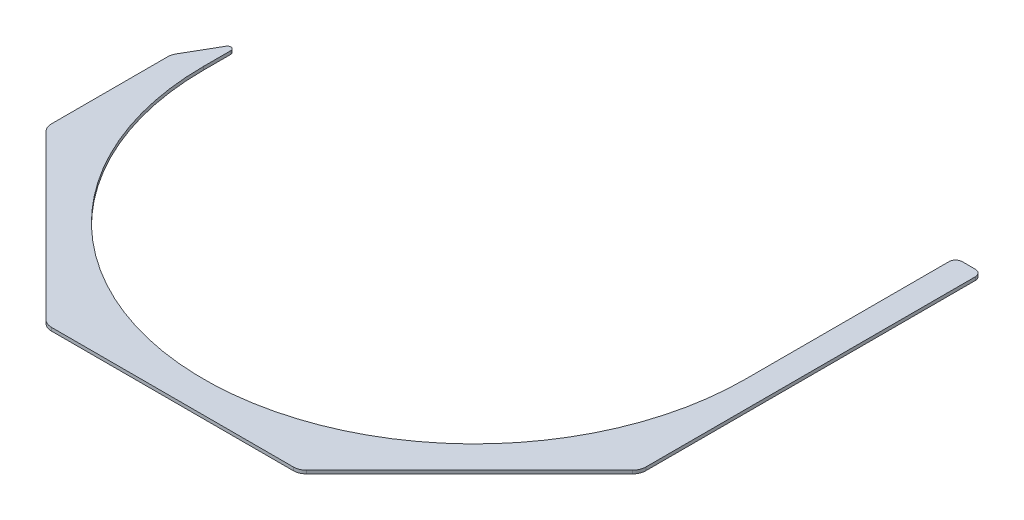
ISO-10303-21;
HEADER;
FILE_DESCRIPTION(('STEP AP214'),'2;1');
FILE_NAME('part.step','',(''),(''),'','','');
FILE_SCHEMA(('AUTOMOTIVE_DESIGN { 1 0 10303 214 1 1 1 1 }'));
ENDSEC;
DATA;
#1=APPLICATION_CONTEXT('core data for automotive mechanical design processes');
#2=APPLICATION_PROTOCOL_DEFINITION('international standard','automotive_design',2000,#1);
#3=PRODUCT_CONTEXT('',#1,'mechanical');
#4=PRODUCT('Part','Part','',(#3));
#5=PRODUCT_RELATED_PRODUCT_CATEGORY('part','',(#4));
#6=PRODUCT_DEFINITION_FORMATION('','',#4);
#7=PRODUCT_DEFINITION_CONTEXT('part definition',#1,'design');
#8=PRODUCT_DEFINITION('design','',#6,#7);
#9=PRODUCT_DEFINITION_SHAPE('','',#8);
#10=(LENGTH_UNIT() NAMED_UNIT(*) SI_UNIT(.MILLI.,.METRE.));
#11=(NAMED_UNIT(*) PLANE_ANGLE_UNIT() SI_UNIT($,.RADIAN.));
#12=(NAMED_UNIT(*) SI_UNIT($,.STERADIAN.) SOLID_ANGLE_UNIT());
#13=UNCERTAINTY_MEASURE_WITH_UNIT(LENGTH_MEASURE(1.E-05),#10,'distance_accuracy_value','');
#14=(GEOMETRIC_REPRESENTATION_CONTEXT(3) GLOBAL_UNCERTAINTY_ASSIGNED_CONTEXT((#13)) GLOBAL_UNIT_ASSIGNED_CONTEXT((#10,
#11,#12)) REPRESENTATION_CONTEXT('',''));
#15=CARTESIAN_POINT('',(0.,0.,0.));
#16=DIRECTION('',(0.,0.,1.));
#17=DIRECTION('',(1.,0.,0.));
#18=AXIS2_PLACEMENT_3D('',#15,#16,#17);
#19=CARTESIAN_POINT('',(-287.3375,3.175,5.89409051225011));
#20=DIRECTION('',(0.866025403784442,0.,0.499999999999994));
#21=DIRECTION('',(0.499999999999994,0.,-0.866025403784442));
#22=AXIS2_PLACEMENT_3D('',#19,#20,#21);
#23=PLANE('',#22);
#24=DIRECTION('',(-0.499999999999994,0.,0.866025403784442));
#25=VECTOR('',#24,1.);
#26=CARTESIAN_POINT('',(-287.3375,0.,5.89409051225011));
#27=LINE('',#26,#25);
#28=CARTESIAN_POINT('',(-267.862130657016,0.,-27.8382386859687));
#29=VERTEX_POINT('',#28);
#30=CARTESIAN_POINT('',(-285.636022628062,0.,2.94704525612538));
#31=VERTEX_POINT('',#30);
#32=EDGE_CURVE('E190',#29,#31,#27,.T.);
#33=ORIENTED_EDGE('',*,*,#32,.T.);
#34=DIRECTION('',(0.,-1.,0.));
#35=VECTOR('',#34,1.);
#36=CARTESIAN_POINT('',(-285.636022628062,3.175,2.94704525612538));
#37=LINE('',#36,#35);
#38=CARTESIAN_POINT('',(-285.636022628062,3.175,2.94704525612538));
#39=VERTEX_POINT('',#38);
#40=EDGE_CURVE('E253',#31,#39,#37,.F.);
#41=ORIENTED_EDGE('',*,*,#40,.T.);
#42=DIRECTION('',(-0.499999999999994,0.,0.866025403784442));
#43=VECTOR('',#42,1.);
#44=CARTESIAN_POINT('',(-287.3375,3.175,5.89409051225011));
#45=LINE('',#44,#43);
#46=CARTESIAN_POINT('',(-267.862130657016,3.175,-27.8382386859687));
#47=VERTEX_POINT('',#46);
#48=EDGE_CURVE('E210',#47,#39,#45,.T.);
#49=ORIENTED_EDGE('',*,*,#48,.F.);
#50=DIRECTION('',(0.,-1.,0.));
#51=VECTOR('',#50,1.);
#52=CARTESIAN_POINT('',(-267.862130657016,3.175,-27.8382386859687));
#53=LINE('',#52,#51);
#54=EDGE_CURVE('E179',#47,#29,#53,.T.);
#55=ORIENTED_EDGE('',*,*,#54,.T.);
#56=EDGE_LOOP('',(#33,#41,#49,#55));
#57=FACE_BOUND('',#56,.T.);
#58=ADVANCED_FACE('F33',(#57),#23,.F.);
#59=CARTESIAN_POINT('',(-287.3375,3.175,5.89409051225011));
#60=DIRECTION('',(1.,0.,0.));
#61=DIRECTION('',(0.,0.,-1.));
#62=AXIS2_PLACEMENT_3D('',#59,#60,#61);
#63=PLANE('',#62);
#64=DIRECTION('',(0.,0.,1.));
#65=VECTOR('',#64,1.);
#66=CARTESIAN_POINT('',(-287.3375,3.175,5.89409051225011));
#67=LINE('',#66,#65);
#68=CARTESIAN_POINT('',(-287.3375,3.175,9.2970452561253));
#69=VERTEX_POINT('',#68);
#70=CARTESIAN_POINT('',(-287.3375,3.175,121.739487757862));
#71=VERTEX_POINT('',#70);
#72=EDGE_CURVE('E309',#69,#71,#67,.T.);
#73=ORIENTED_EDGE('',*,*,#72,.F.);
#74=DIRECTION('',(0.,-1.,0.));
#75=VECTOR('',#74,1.);
#76=CARTESIAN_POINT('',(-287.3375,3.175,9.2970452561253));
#77=LINE('',#76,#75);
#78=CARTESIAN_POINT('',(-287.3375,0.,9.2970452561253));
#79=VERTEX_POINT('',#78);
#80=EDGE_CURVE('E250',#69,#79,#77,.T.);
#81=ORIENTED_EDGE('',*,*,#80,.T.);
#82=DIRECTION('',(0.,0.,1.));
#83=VECTOR('',#82,1.);
#84=CARTESIAN_POINT('',(-287.3375,0.,5.89409051225011));
#85=LINE('',#84,#83);
#86=CARTESIAN_POINT('',(-287.3375,0.,121.739487757862));
#87=VERTEX_POINT('',#86);
#88=EDGE_CURVE('E193',#79,#87,#85,.T.);
#89=ORIENTED_EDGE('',*,*,#88,.T.);
#90=DIRECTION('',(0.,1.,0.));
#91=VECTOR('',#90,1.);
#92=CARTESIAN_POINT('',(-287.3375,3.175,121.739487757862));
#93=LINE('',#92,#91);
#94=EDGE_CURVE('E247',#87,#71,#93,.T.);
#95=ORIENTED_EDGE('',*,*,#94,.T.);
#96=EDGE_LOOP('',(#73,#81,#89,#95));
#97=FACE_BOUND('',#96,.T.);
#98=ADVANCED_FACE('F339',(#97),#63,.F.);
#99=CARTESIAN_POINT('',(287.3375,3.175,292.1));
#100=DIRECTION('',(0.,0.,-1.));
#101=DIRECTION('',(-1.,0.,0.));
#102=AXIS2_PLACEMENT_3D('',#99,#100,#101);
#103=PLANE('',#102);
#104=DIRECTION('',(1.,0.,0.));
#105=VECTOR('',#104,1.);
#106=CARTESIAN_POINT('',(287.3375,3.175,292.1));
#107=LINE('',#106,#105);
#108=CARTESIAN_POINT('',(-116.976987757862,3.175,292.1));
#109=VERTEX_POINT('',#108);
#110=CARTESIAN_POINT('',(116.976987757862,3.175,292.1));
#111=VERTEX_POINT('',#110);
#112=EDGE_CURVE('E312',#109,#111,#107,.T.);
#113=ORIENTED_EDGE('',*,*,#112,.F.);
#114=DIRECTION('',(0.,1.,0.));
#115=VECTOR('',#114,1.);
#116=CARTESIAN_POINT('',(-116.976987757862,3.175,292.1));
#117=LINE('',#116,#115);
#118=CARTESIAN_POINT('',(-116.976987757862,0.,292.1));
#119=VERTEX_POINT('',#118);
#120=EDGE_CURVE('E263',#109,#119,#117,.F.);
#121=ORIENTED_EDGE('',*,*,#120,.T.);
#122=DIRECTION('',(1.,0.,0.));
#123=VECTOR('',#122,1.);
#124=CARTESIAN_POINT('',(287.3375,0.,292.1));
#125=LINE('',#124,#123);
#126=CARTESIAN_POINT('',(116.976987757862,0.,292.1));
#127=VERTEX_POINT('',#126);
#128=EDGE_CURVE('E197',#119,#127,#125,.T.);
#129=ORIENTED_EDGE('',*,*,#128,.T.);
#130=DIRECTION('',(0.,1.,0.));
#131=VECTOR('',#130,1.);
#132=CARTESIAN_POINT('',(116.976987757862,3.175,292.1));
#133=LINE('',#132,#131);
#134=EDGE_CURVE('E260',#127,#111,#133,.T.);
#135=ORIENTED_EDGE('',*,*,#134,.T.);
#136=EDGE_LOOP('',(#113,#121,#129,#135));
#137=FACE_BOUND('',#136,.T.);
#138=ADVANCED_FACE('F319',(#137),#103,.F.);
#139=CARTESIAN_POINT('',(287.3375,3.175,292.1));
#140=DIRECTION('',(-1.,0.,0.));
#141=DIRECTION('',(0.,0.,1.));
#142=AXIS2_PLACEMENT_3D('',#139,#140,#141);
#143=PLANE('',#142);
#144=DIRECTION('',(0.,0.,-1.));
#145=VECTOR('',#144,1.);
#146=CARTESIAN_POINT('',(287.3375,0.,292.1));
#147=LINE('',#146,#145);
#148=CARTESIAN_POINT('',(287.3375,0.,121.739487757862));
#149=VERTEX_POINT('',#148);
#150=CARTESIAN_POINT('',(287.3375,0.,-196.85));
#151=VERTEX_POINT('',#150);
#152=EDGE_CURVE('E200',#149,#151,#147,.T.);
#153=ORIENTED_EDGE('',*,*,#152,.T.);
#154=DIRECTION('',(0.,-1.,0.));
#155=VECTOR('',#154,1.);
#156=CARTESIAN_POINT('',(287.3375,3.175,-196.85));
#157=LINE('',#156,#155);
#158=CARTESIAN_POINT('',(287.3375,3.175,-196.85));
#159=VERTEX_POINT('',#158);
#160=EDGE_CURVE('E11',#151,#159,#157,.F.);
#161=ORIENTED_EDGE('',*,*,#160,.T.);
#162=DIRECTION('',(0.,0.,-1.));
#163=VECTOR('',#162,1.);
#164=CARTESIAN_POINT('',(287.3375,3.175,292.1));
#165=LINE('',#164,#163);
#166=CARTESIAN_POINT('',(287.3375,3.175,121.739487757862));
#167=VERTEX_POINT('',#166);
#168=EDGE_CURVE('E277',#167,#159,#165,.T.);
#169=ORIENTED_EDGE('',*,*,#168,.F.);
#170=DIRECTION('',(0.,1.,0.));
#171=VECTOR('',#170,1.);
#172=CARTESIAN_POINT('',(287.3375,3.175,121.739487757862));
#173=LINE('',#172,#171);
#174=EDGE_CURVE('E235',#167,#149,#173,.F.);
#175=ORIENTED_EDGE('',*,*,#174,.T.);
#176=EDGE_LOOP('',(#153,#161,#169,#175));
#177=FACE_BOUND('',#176,.T.);
#178=ADVANCED_FACE('F286',(#177),#143,.F.);
#179=CARTESIAN_POINT('',(287.3375,3.175,-203.2));
#180=DIRECTION('',(0.,0.,1.));
#181=DIRECTION('',(1.,0.,0.));
#182=AXIS2_PLACEMENT_3D('',#179,#180,#181);
#183=PLANE('',#182);
#184=DIRECTION('',(-1.,0.,0.));
#185=VECTOR('',#184,1.);
#186=CARTESIAN_POINT('',(287.3375,0.,-203.2));
#187=LINE('',#186,#185);
#188=CARTESIAN_POINT('',(280.9875,0.,-203.2));
#189=VERTEX_POINT('',#188);
#190=CARTESIAN_POINT('',(268.2875,0.,-203.2));
#191=VERTEX_POINT('',#190);
#192=EDGE_CURVE('E202',#189,#191,#187,.T.);
#193=ORIENTED_EDGE('',*,*,#192,.T.);
#194=DIRECTION('',(0.,-1.,0.));
#195=VECTOR('',#194,1.);
#196=CARTESIAN_POINT('',(268.2875,3.175,-203.2));
#197=LINE('',#196,#195);
#198=CARTESIAN_POINT('',(268.2875,3.175,-203.2));
#199=VERTEX_POINT('',#198);
#200=EDGE_CURVE('E54',#191,#199,#197,.F.);
#201=ORIENTED_EDGE('',*,*,#200,.T.);
#202=DIRECTION('',(-1.,0.,0.));
#203=VECTOR('',#202,1.);
#204=CARTESIAN_POINT('',(287.3375,3.175,-203.2));
#205=LINE('',#204,#203);
#206=CARTESIAN_POINT('',(280.9875,3.175,-203.2));
#207=VERTEX_POINT('',#206);
#208=EDGE_CURVE('E170',#207,#199,#205,.T.);
#209=ORIENTED_EDGE('',*,*,#208,.F.);
#210=DIRECTION('',(0.,-1.,0.));
#211=VECTOR('',#210,1.);
#212=CARTESIAN_POINT('',(280.9875,3.175,-203.2));
#213=LINE('',#212,#211);
#214=EDGE_CURVE('E271',#207,#189,#213,.T.);
#215=ORIENTED_EDGE('',*,*,#214,.T.);
#216=EDGE_LOOP('',(#193,#201,#209,#215));
#217=FACE_BOUND('',#216,.T.);
#218=ADVANCED_FACE('F280',(#217),#183,.F.);
#219=CARTESIAN_POINT('',(261.9375,3.175,-203.2));
#220=DIRECTION('',(1.,0.,0.));
#221=DIRECTION('',(0.,0.,-1.));
#222=AXIS2_PLACEMENT_3D('',#219,#220,#221);
#223=PLANE('',#222);
#224=DIRECTION('',(0.,0.,1.));
#225=VECTOR('',#224,1.);
#226=CARTESIAN_POINT('',(261.9375,3.175,-203.2));
#227=LINE('',#226,#225);
#228=CARTESIAN_POINT('',(261.9375,3.175,-196.85));
#229=VERTEX_POINT('',#228);
#230=CARTESIAN_POINT('',(261.9375,3.175,0.));
#231=VERTEX_POINT('',#230);
#232=EDGE_CURVE('E159',#229,#231,#227,.T.);
#233=ORIENTED_EDGE('',*,*,#232,.F.);
#234=DIRECTION('',(0.,-1.,0.));
#235=VECTOR('',#234,1.);
#236=CARTESIAN_POINT('',(261.9375,3.175,-196.85));
#237=LINE('',#236,#235);
#238=CARTESIAN_POINT('',(261.9375,0.,-196.85));
#239=VERTEX_POINT('',#238);
#240=EDGE_CURVE('E265',#229,#239,#237,.T.);
#241=ORIENTED_EDGE('',*,*,#240,.T.);
#242=DIRECTION('',(0.,0.,1.));
#243=VECTOR('',#242,1.);
#244=CARTESIAN_POINT('',(261.9375,0.,-203.2));
#245=LINE('',#244,#243);
#246=CARTESIAN_POINT('',(261.9375,0.,0.));
#247=VERTEX_POINT('',#246);
#248=EDGE_CURVE('E176',#239,#247,#245,.T.);
#249=ORIENTED_EDGE('',*,*,#248,.T.);
#250=DIRECTION('',(0.,-1.,0.));
#251=VECTOR('',#250,1.);
#252=CARTESIAN_POINT('',(261.9375,3.175,0.));
#253=LINE('',#252,#251);
#254=EDGE_CURVE('E173',#231,#247,#253,.T.);
#255=ORIENTED_EDGE('',*,*,#254,.F.);
#256=EDGE_LOOP('',(#233,#241,#249,#255));
#257=FACE_BOUND('',#256,.T.);
#258=ADVANCED_FACE('F174',(#257),#223,.F.);
#259=CARTESIAN_POINT('',(0.,3.175,0.));
#260=DIRECTION('',(0.,-1.,0.));
#261=DIRECTION('',(0.,0.,-1.));
#262=AXIS2_PLACEMENT_3D('',#259,#260,#261);
#263=CYLINDRICAL_SURFACE('',#262,261.9375);
#264=CARTESIAN_POINT('',(0.,0.,0.));
#265=DIRECTION('',(0.,-1.,0.));
#266=DIRECTION('',(0.,0.,1.));
#267=AXIS2_PLACEMENT_3D('',#264,#265,#266);
#268=CIRCLE('',#267,261.9375);
#269=CARTESIAN_POINT('',(-261.9375,0.,1.81306074033886E-12));
#270=VERTEX_POINT('',#269);
#271=EDGE_CURVE('E205',#247,#270,#268,.T.);
#272=ORIENTED_EDGE('',*,*,#271,.T.);
#273=DIRECTION('',(0.,-1.,0.));
#274=VECTOR('',#273,1.);
#275=CARTESIAN_POINT('',(-261.9375,3.175,1.81306074033886E-12));
#276=LINE('',#275,#274);
#277=CARTESIAN_POINT('',(-261.9375,3.175,1.81306074033886E-12));
#278=VERTEX_POINT('',#277);
#279=EDGE_CURVE('E180',#278,#270,#276,.T.);
#280=ORIENTED_EDGE('',*,*,#279,.F.);
#281=CARTESIAN_POINT('',(0.,3.175,0.));
#282=DIRECTION('',(0.,-1.,0.));
#283=DIRECTION('',(0.,0.,1.));
#284=AXIS2_PLACEMENT_3D('',#281,#282,#283);
#285=CIRCLE('',#284,261.9375);
#286=EDGE_CURVE('E164',#231,#278,#285,.T.);
#287=ORIENTED_EDGE('',*,*,#286,.F.);
#288=ORIENTED_EDGE('',*,*,#254,.T.);
#289=EDGE_LOOP('',(#272,#280,#287,#288));
#290=FACE_BOUND('',#289,.T.);
#291=ADVANCED_FACE('F182',(#290),#263,.F.);
#292=CARTESIAN_POINT('',(-261.9375,3.175,1.82909978638645E-12));
#293=DIRECTION('',(-1.,0.,0.));
#294=DIRECTION('',(0.,0.,1.));
#295=AXIS2_PLACEMENT_3D('',#292,#293,#294);
#296=PLANE('',#295);
#297=DIRECTION('',(0.,0.,-1.));
#298=VECTOR('',#297,1.);
#299=CARTESIAN_POINT('',(-261.9375,0.,1.82909978638645E-12));
#300=LINE('',#299,#298);
#301=CARTESIAN_POINT('',(-261.9375,0.,-26.2507386859687));
#302=VERTEX_POINT('',#301);
#303=EDGE_CURVE('E207',#270,#302,#300,.T.);
#304=ORIENTED_EDGE('',*,*,#303,.T.);
#305=DIRECTION('',(0.,-1.,0.));
#306=VECTOR('',#305,1.);
#307=CARTESIAN_POINT('',(-261.9375,3.175,-26.2507386859687));
#308=LINE('',#307,#306);
#309=CARTESIAN_POINT('',(-261.9375,3.175,-26.2507386859687));
#310=VERTEX_POINT('',#309);
#311=EDGE_CURVE('E216',#302,#310,#308,.F.);
#312=ORIENTED_EDGE('',*,*,#311,.T.);
#313=DIRECTION('',(0.,0.,-1.));
#314=VECTOR('',#313,1.);
#315=CARTESIAN_POINT('',(-261.9375,3.175,1.82909978638645E-12));
#316=LINE('',#315,#314);
#317=EDGE_CURVE('E185',#278,#310,#316,.T.);
#318=ORIENTED_EDGE('',*,*,#317,.F.);
#319=ORIENTED_EDGE('',*,*,#279,.T.);
#320=EDGE_LOOP('',(#304,#312,#318,#319));
#321=FACE_BOUND('',#320,.T.);
#322=ADVANCED_FACE('F355',(#321),#296,.F.);
#323=CARTESIAN_POINT('',(0.,3.175,0.));
#324=DIRECTION('',(0.,1.,0.));
#325=DIRECTION('',(0.,0.,1.));
#326=AXIS2_PLACEMENT_3D('',#323,#324,#325);
#327=PLANE('',#326);
#328=ORIENTED_EDGE('',*,*,#208,.T.);
#329=CARTESIAN_POINT('',(268.2875,3.175,-196.85));
#330=DIRECTION('',(0.,1.,0.));
#331=DIRECTION('',(0.,0.,1.));
#332=AXIS2_PLACEMENT_3D('',#329,#330,#331);
#333=CIRCLE('',#332,6.35);
#334=EDGE_CURVE('E41',#199,#229,#333,.T.);
#335=ORIENTED_EDGE('',*,*,#334,.T.);
#336=ORIENTED_EDGE('',*,*,#232,.T.);
#337=ORIENTED_EDGE('',*,*,#286,.T.);
#338=ORIENTED_EDGE('',*,*,#317,.T.);
#339=CARTESIAN_POINT('',(-265.1125,3.175,-26.2507386859687));
#340=DIRECTION('',(0.,1.,0.));
#341=DIRECTION('',(0.,0.,1.));
#342=AXIS2_PLACEMENT_3D('',#339,#340,#341);
#343=CIRCLE('',#342,3.175);
#344=EDGE_CURVE('E218',#310,#47,#343,.T.);
#345=ORIENTED_EDGE('',*,*,#344,.T.);
#346=ORIENTED_EDGE('',*,*,#48,.T.);
#347=CARTESIAN_POINT('',(-274.6375,3.175,9.2970452561253));
#348=DIRECTION('',(0.,1.,0.));
#349=DIRECTION('',(0.,0.,1.));
#350=AXIS2_PLACEMENT_3D('',#347,#348,#349);
#351=CIRCLE('',#350,12.7);
#352=EDGE_CURVE('E231',#39,#69,#351,.T.);
#353=ORIENTED_EDGE('',*,*,#352,.T.);
#354=ORIENTED_EDGE('',*,*,#72,.T.);
#355=CARTESIAN_POINT('',(-274.6375,3.175,121.739487757862));
#356=DIRECTION('',(0.,1.,0.));
#357=DIRECTION('',(0.,0.,1.));
#358=AXIS2_PLACEMENT_3D('',#355,#356,#357);
#359=CIRCLE('',#358,12.7);
#360=CARTESIAN_POINT('',(-283.617756121069,3.175,130.719743878931));
#361=VERTEX_POINT('',#360);
#362=EDGE_CURVE('E229',#71,#361,#359,.T.);
#363=ORIENTED_EDGE('',*,*,#362,.T.);
#364=DIRECTION('',(-0.707106781186548,0.,-0.707106781186547));
#365=VECTOR('',#364,1.);
#366=CARTESIAN_POINT('',(-122.2375,3.175,292.1));
#367=LINE('',#366,#365);
#368=CARTESIAN_POINT('',(-125.957243878931,3.175,288.380256121069));
#369=VERTEX_POINT('',#368);
#370=EDGE_CURVE('E304',#369,#361,#367,.T.);
#371=ORIENTED_EDGE('',*,*,#370,.F.);
#372=CARTESIAN_POINT('',(-116.976987757862,3.175,279.4));
#373=DIRECTION('',(0.,1.,0.));
#374=DIRECTION('',(0.,0.,1.));
#375=AXIS2_PLACEMENT_3D('',#372,#373,#374);
#376=CIRCLE('',#375,12.7);
#377=EDGE_CURVE('E227',#369,#109,#376,.T.);
#378=ORIENTED_EDGE('',*,*,#377,.T.);
#379=ORIENTED_EDGE('',*,*,#112,.T.);
#380=CARTESIAN_POINT('',(116.976987757862,3.175,279.4));
#381=DIRECTION('',(0.,1.,0.));
#382=DIRECTION('',(0.,0.,1.));
#383=AXIS2_PLACEMENT_3D('',#380,#381,#382);
#384=CIRCLE('',#383,12.7);
#385=CARTESIAN_POINT('',(125.957243878931,3.175,288.380256121069));
#386=VERTEX_POINT('',#385);
#387=EDGE_CURVE('E225',#111,#386,#384,.T.);
#388=ORIENTED_EDGE('',*,*,#387,.T.);
#389=DIRECTION('',(-0.707106781186547,0.,0.707106781186548));
#390=VECTOR('',#389,1.);
#391=CARTESIAN_POINT('',(122.2375,3.175,292.1));
#392=LINE('',#391,#390);
#393=CARTESIAN_POINT('',(283.617756121069,3.175,130.719743878931));
#394=VERTEX_POINT('',#393);
#395=EDGE_CURVE('E299',#394,#386,#392,.T.);
#396=ORIENTED_EDGE('',*,*,#395,.F.);
#397=CARTESIAN_POINT('',(274.6375,3.175,121.739487757862));
#398=DIRECTION('',(0.,1.,0.));
#399=DIRECTION('',(0.,0.,1.));
#400=AXIS2_PLACEMENT_3D('',#397,#398,#399);
#401=CIRCLE('',#400,12.7);
#402=EDGE_CURVE('E233',#394,#167,#401,.T.);
#403=ORIENTED_EDGE('',*,*,#402,.T.);
#404=ORIENTED_EDGE('',*,*,#168,.T.);
#405=CARTESIAN_POINT('',(280.9875,3.175,-196.85));
#406=DIRECTION('',(0.,1.,0.));
#407=DIRECTION('',(0.,0.,1.));
#408=AXIS2_PLACEMENT_3D('',#405,#406,#407);
#409=CIRCLE('',#408,6.35);
#410=EDGE_CURVE('E275',#159,#207,#409,.T.);
#411=ORIENTED_EDGE('',*,*,#410,.T.);
#412=EDGE_LOOP('',(#328,#335,#336,#337,#338,#345,#346,#353,#354,#363,#371,#378,#379,#388,#396,
#403,#404,#411));
#413=FACE_BOUND('',#412,.T.);
#414=ADVANCED_FACE('F161',(#413),#327,.T.);
#415=CARTESIAN_POINT('',(0.,0.,0.));
#416=DIRECTION('',(0.,1.,0.));
#417=DIRECTION('',(0.,0.,1.));
#418=AXIS2_PLACEMENT_3D('',#415,#416,#417);
#419=PLANE('',#418);
#420=ORIENTED_EDGE('',*,*,#248,.F.);
#421=CARTESIAN_POINT('',(268.2875,0.,-196.85));
#422=DIRECTION('',(0.,1.,0.));
#423=DIRECTION('',(0.,0.,1.));
#424=AXIS2_PLACEMENT_3D('',#421,#422,#423);
#425=CIRCLE('',#424,6.35);
#426=EDGE_CURVE('E269',#239,#191,#425,.F.);
#427=ORIENTED_EDGE('',*,*,#426,.T.);
#428=ORIENTED_EDGE('',*,*,#192,.F.);
#429=CARTESIAN_POINT('',(280.9875,0.,-196.85));
#430=DIRECTION('',(0.,1.,0.));
#431=DIRECTION('',(0.,0.,1.));
#432=AXIS2_PLACEMENT_3D('',#429,#430,#431);
#433=CIRCLE('',#432,6.35);
#434=EDGE_CURVE('E267',#189,#151,#433,.F.);
#435=ORIENTED_EDGE('',*,*,#434,.T.);
#436=ORIENTED_EDGE('',*,*,#152,.F.);
#437=CARTESIAN_POINT('',(274.6375,0.,121.739487757862));
#438=DIRECTION('',(0.,1.,0.));
#439=DIRECTION('',(0.,0.,1.));
#440=AXIS2_PLACEMENT_3D('',#437,#438,#439);
#441=CIRCLE('',#440,12.7);
#442=CARTESIAN_POINT('',(283.617756121069,0.,130.719743878931));
#443=VERTEX_POINT('',#442);
#444=EDGE_CURVE('E245',#149,#443,#441,.F.);
#445=ORIENTED_EDGE('',*,*,#444,.T.);
#446=DIRECTION('',(-0.707106781186547,0.,0.707106781186548));
#447=VECTOR('',#446,1.);
#448=CARTESIAN_POINT('',(122.2375,0.,292.1));
#449=LINE('',#448,#447);
#450=CARTESIAN_POINT('',(125.957243878931,0.,288.380256121069));
#451=VERTEX_POINT('',#450);
#452=EDGE_CURVE('E194',#443,#451,#449,.T.);
#453=ORIENTED_EDGE('',*,*,#452,.T.);
#454=CARTESIAN_POINT('',(116.976987757862,0.,279.4));
#455=DIRECTION('',(0.,1.,0.));
#456=DIRECTION('',(0.,0.,1.));
#457=AXIS2_PLACEMENT_3D('',#454,#455,#456);
#458=CIRCLE('',#457,12.7);
#459=EDGE_CURVE('E237',#451,#127,#458,.F.);
#460=ORIENTED_EDGE('',*,*,#459,.T.);
#461=ORIENTED_EDGE('',*,*,#128,.F.);
#462=CARTESIAN_POINT('',(-116.976987757862,0.,279.4));
#463=DIRECTION('',(0.,1.,0.));
#464=DIRECTION('',(0.,0.,1.));
#465=AXIS2_PLACEMENT_3D('',#462,#463,#464);
#466=CIRCLE('',#465,12.7);
#467=CARTESIAN_POINT('',(-125.957243878931,0.,288.380256121069));
#468=VERTEX_POINT('',#467);
#469=EDGE_CURVE('E239',#119,#468,#466,.F.);
#470=ORIENTED_EDGE('',*,*,#469,.T.);
#471=DIRECTION('',(-0.707106781186548,0.,-0.707106781186547));
#472=VECTOR('',#471,1.);
#473=CARTESIAN_POINT('',(-122.2375,0.,292.1));
#474=LINE('',#473,#472);
#475=CARTESIAN_POINT('',(-283.617756121069,0.,130.719743878931));
#476=VERTEX_POINT('',#475);
#477=EDGE_CURVE('E301',#468,#476,#474,.T.);
#478=ORIENTED_EDGE('',*,*,#477,.T.);
#479=CARTESIAN_POINT('',(-274.6375,0.,121.739487757862));
#480=DIRECTION('',(0.,1.,0.));
#481=DIRECTION('',(0.,0.,1.));
#482=AXIS2_PLACEMENT_3D('',#479,#480,#481);
#483=CIRCLE('',#482,12.7);
#484=EDGE_CURVE('E241',#476,#87,#483,.F.);
#485=ORIENTED_EDGE('',*,*,#484,.T.);
#486=ORIENTED_EDGE('',*,*,#88,.F.);
#487=CARTESIAN_POINT('',(-274.6375,0.,9.2970452561253));
#488=DIRECTION('',(0.,1.,0.));
#489=DIRECTION('',(0.,0.,1.));
#490=AXIS2_PLACEMENT_3D('',#487,#488,#489);
#491=CIRCLE('',#490,12.7);
#492=EDGE_CURVE('E243',#79,#31,#491,.F.);
#493=ORIENTED_EDGE('',*,*,#492,.T.);
#494=ORIENTED_EDGE('',*,*,#32,.F.);
#495=CARTESIAN_POINT('',(-265.1125,0.,-26.2507386859687));
#496=DIRECTION('',(0.,1.,0.));
#497=DIRECTION('',(0.,0.,1.));
#498=AXIS2_PLACEMENT_3D('',#495,#496,#497);
#499=CIRCLE('',#498,3.175);
#500=EDGE_CURVE('E214',#29,#302,#499,.F.);
#501=ORIENTED_EDGE('',*,*,#500,.T.);
#502=ORIENTED_EDGE('',*,*,#303,.F.);
#503=ORIENTED_EDGE('',*,*,#271,.F.);
#504=EDGE_LOOP('',(#420,#427,#428,#435,#436,#445,#453,#460,#461,#470,#478,#485,#486,#493,#494,
#501,#502,#503));
#505=FACE_BOUND('',#504,.T.);
#506=ADVANCED_FACE('F284',(#505),#419,.F.);
#507=CARTESIAN_POINT('',(-265.1125,3.175,-26.2507386859687));
#508=DIRECTION('',(0.,-1.,0.));
#509=DIRECTION('',(0.,0.,-1.));
#510=AXIS2_PLACEMENT_3D('',#507,#508,#509);
#511=CYLINDRICAL_SURFACE('',#510,3.175);
#512=ORIENTED_EDGE('',*,*,#344,.F.);
#513=ORIENTED_EDGE('',*,*,#311,.F.);
#514=ORIENTED_EDGE('',*,*,#500,.F.);
#515=ORIENTED_EDGE('',*,*,#54,.F.);
#516=EDGE_LOOP('',(#512,#513,#514,#515));
#517=FACE_BOUND('',#516,.T.);
#518=ADVANCED_FACE('F351',(#517),#511,.T.);
#519=CARTESIAN_POINT('',(122.2375,0.,292.1));
#520=DIRECTION('',(-0.707106781186548,0.,-0.707106781186547));
#521=DIRECTION('',(-0.707106781186547,0.,0.707106781186548));
#522=AXIS2_PLACEMENT_3D('',#519,#520,#521);
#523=PLANE('',#522);
#524=ORIENTED_EDGE('',*,*,#452,.F.);
#525=DIRECTION('',(0.,1.,0.));
#526=VECTOR('',#525,1.);
#527=CARTESIAN_POINT('',(283.617756121069,0.,130.719743878931));
#528=LINE('',#527,#526);
#529=EDGE_CURVE('E222',#443,#394,#528,.T.);
#530=ORIENTED_EDGE('',*,*,#529,.T.);
#531=ORIENTED_EDGE('',*,*,#395,.T.);
#532=DIRECTION('',(0.,1.,0.));
#533=VECTOR('',#532,1.);
#534=CARTESIAN_POINT('',(125.957243878931,0.,288.380256121069));
#535=LINE('',#534,#533);
#536=EDGE_CURVE('E220',#386,#451,#535,.F.);
#537=ORIENTED_EDGE('',*,*,#536,.T.);
#538=EDGE_LOOP('',(#524,#530,#531,#537));
#539=FACE_BOUND('',#538,.T.);
#540=ADVANCED_FACE('F295',(#539),#523,.F.);
#541=CARTESIAN_POINT('',(-122.2375,0.,292.1));
#542=DIRECTION('',(0.707106781186547,0.,-0.707106781186548));
#543=DIRECTION('',(-0.707106781186548,0.,-0.707106781186547));
#544=AXIS2_PLACEMENT_3D('',#541,#542,#543);
#545=PLANE('',#544);
#546=ORIENTED_EDGE('',*,*,#370,.T.);
#547=DIRECTION('',(0.,1.,0.));
#548=VECTOR('',#547,1.);
#549=CARTESIAN_POINT('',(-283.617756121069,0.,130.719743878931));
#550=LINE('',#549,#548);
#551=EDGE_CURVE('E258',#361,#476,#550,.F.);
#552=ORIENTED_EDGE('',*,*,#551,.T.);
#553=ORIENTED_EDGE('',*,*,#477,.F.);
#554=DIRECTION('',(0.,1.,0.));
#555=VECTOR('',#554,1.);
#556=CARTESIAN_POINT('',(-125.957243878931,0.,288.380256121069));
#557=LINE('',#556,#555);
#558=EDGE_CURVE('E255',#468,#369,#557,.T.);
#559=ORIENTED_EDGE('',*,*,#558,.T.);
#560=EDGE_LOOP('',(#546,#552,#553,#559));
#561=FACE_BOUND('',#560,.T.);
#562=ADVANCED_FACE('F331',(#561),#545,.F.);
#563=CARTESIAN_POINT('',(274.6375,0.,121.739487757862));
#564=DIRECTION('',(0.,1.,0.));
#565=DIRECTION('',(0.,0.,1.));
#566=AXIS2_PLACEMENT_3D('',#563,#564,#565);
#567=CYLINDRICAL_SURFACE('',#566,12.7);
#568=ORIENTED_EDGE('',*,*,#444,.F.);
#569=ORIENTED_EDGE('',*,*,#174,.F.);
#570=ORIENTED_EDGE('',*,*,#402,.F.);
#571=ORIENTED_EDGE('',*,*,#529,.F.);
#572=EDGE_LOOP('',(#568,#569,#570,#571));
#573=FACE_BOUND('',#572,.T.);
#574=ADVANCED_FACE('F289',(#573),#567,.T.);
#575=CARTESIAN_POINT('',(-274.6375,3.175,9.2970452561253));
#576=DIRECTION('',(0.,-1.,0.));
#577=DIRECTION('',(0.,0.,-1.));
#578=AXIS2_PLACEMENT_3D('',#575,#576,#577);
#579=CYLINDRICAL_SURFACE('',#578,12.7);
#580=ORIENTED_EDGE('',*,*,#352,.F.);
#581=ORIENTED_EDGE('',*,*,#40,.F.);
#582=ORIENTED_EDGE('',*,*,#492,.F.);
#583=ORIENTED_EDGE('',*,*,#80,.F.);
#584=EDGE_LOOP('',(#580,#581,#582,#583));
#585=FACE_BOUND('',#584,.T.);
#586=ADVANCED_FACE('F343',(#585),#579,.T.);
#587=CARTESIAN_POINT('',(-274.6375,3.175,121.739487757862));
#588=DIRECTION('',(0.,1.,0.));
#589=DIRECTION('',(0.,0.,1.));
#590=AXIS2_PLACEMENT_3D('',#587,#588,#589);
#591=CYLINDRICAL_SURFACE('',#590,12.7);
#592=ORIENTED_EDGE('',*,*,#484,.F.);
#593=ORIENTED_EDGE('',*,*,#551,.F.);
#594=ORIENTED_EDGE('',*,*,#362,.F.);
#595=ORIENTED_EDGE('',*,*,#94,.F.);
#596=EDGE_LOOP('',(#592,#593,#594,#595));
#597=FACE_BOUND('',#596,.T.);
#598=ADVANCED_FACE('F334',(#597),#591,.T.);
#599=CARTESIAN_POINT('',(-116.976987757862,0.,279.4));
#600=DIRECTION('',(0.,1.,0.));
#601=DIRECTION('',(0.,0.,1.));
#602=AXIS2_PLACEMENT_3D('',#599,#600,#601);
#603=CYLINDRICAL_SURFACE('',#602,12.7);
#604=ORIENTED_EDGE('',*,*,#469,.F.);
#605=ORIENTED_EDGE('',*,*,#120,.F.);
#606=ORIENTED_EDGE('',*,*,#377,.F.);
#607=ORIENTED_EDGE('',*,*,#558,.F.);
#608=EDGE_LOOP('',(#604,#605,#606,#607));
#609=FACE_BOUND('',#608,.T.);
#610=ADVANCED_FACE('F324',(#609),#603,.T.);
#611=CARTESIAN_POINT('',(116.976987757862,3.175,279.4));
#612=DIRECTION('',(0.,1.,0.));
#613=DIRECTION('',(0.,0.,1.));
#614=AXIS2_PLACEMENT_3D('',#611,#612,#613);
#615=CYLINDRICAL_SURFACE('',#614,12.7);
#616=ORIENTED_EDGE('',*,*,#459,.F.);
#617=ORIENTED_EDGE('',*,*,#536,.F.);
#618=ORIENTED_EDGE('',*,*,#387,.F.);
#619=ORIENTED_EDGE('',*,*,#134,.F.);
#620=EDGE_LOOP('',(#616,#617,#618,#619));
#621=FACE_BOUND('',#620,.T.);
#622=ADVANCED_FACE('F385',(#621),#615,.T.);
#623=CARTESIAN_POINT('',(268.2875,3.175,-196.85));
#624=DIRECTION('',(0.,-1.,0.));
#625=DIRECTION('',(0.,0.,-1.));
#626=AXIS2_PLACEMENT_3D('',#623,#624,#625);
#627=CYLINDRICAL_SURFACE('',#626,6.35);
#628=ORIENTED_EDGE('',*,*,#334,.F.);
#629=ORIENTED_EDGE('',*,*,#200,.F.);
#630=ORIENTED_EDGE('',*,*,#426,.F.);
#631=ORIENTED_EDGE('',*,*,#240,.F.);
#632=EDGE_LOOP('',(#628,#629,#630,#631));
#633=FACE_BOUND('',#632,.T.);
#634=ADVANCED_FACE('F387',(#633),#627,.T.);
#635=CARTESIAN_POINT('',(280.9875,3.175,-196.85));
#636=DIRECTION('',(0.,-1.,0.));
#637=DIRECTION('',(0.,0.,-1.));
#638=AXIS2_PLACEMENT_3D('',#635,#636,#637);
#639=CYLINDRICAL_SURFACE('',#638,6.35);
#640=ORIENTED_EDGE('',*,*,#410,.F.);
#641=ORIENTED_EDGE('',*,*,#160,.F.);
#642=ORIENTED_EDGE('',*,*,#434,.F.);
#643=ORIENTED_EDGE('',*,*,#214,.F.);
#644=EDGE_LOOP('',(#640,#641,#642,#643));
#645=FACE_BOUND('',#644,.T.);
#646=ADVANCED_FACE('F35',(#645),#639,.T.);
#647=CLOSED_SHELL('',(#58,#98,#138,#178,#218,#258,#291,#322,#414,#506,#518,#540,#562,#574,#586,
#598,#610,#622,#634,#646));
#648=MANIFOLD_SOLID_BREP('B2',#647);
#649=ADVANCED_BREP_SHAPE_REPRESENTATION('',(#18,#648),#14);
#650=SHAPE_DEFINITION_REPRESENTATION(#9,#649);
ENDSEC;
END-ISO-10303-21;
